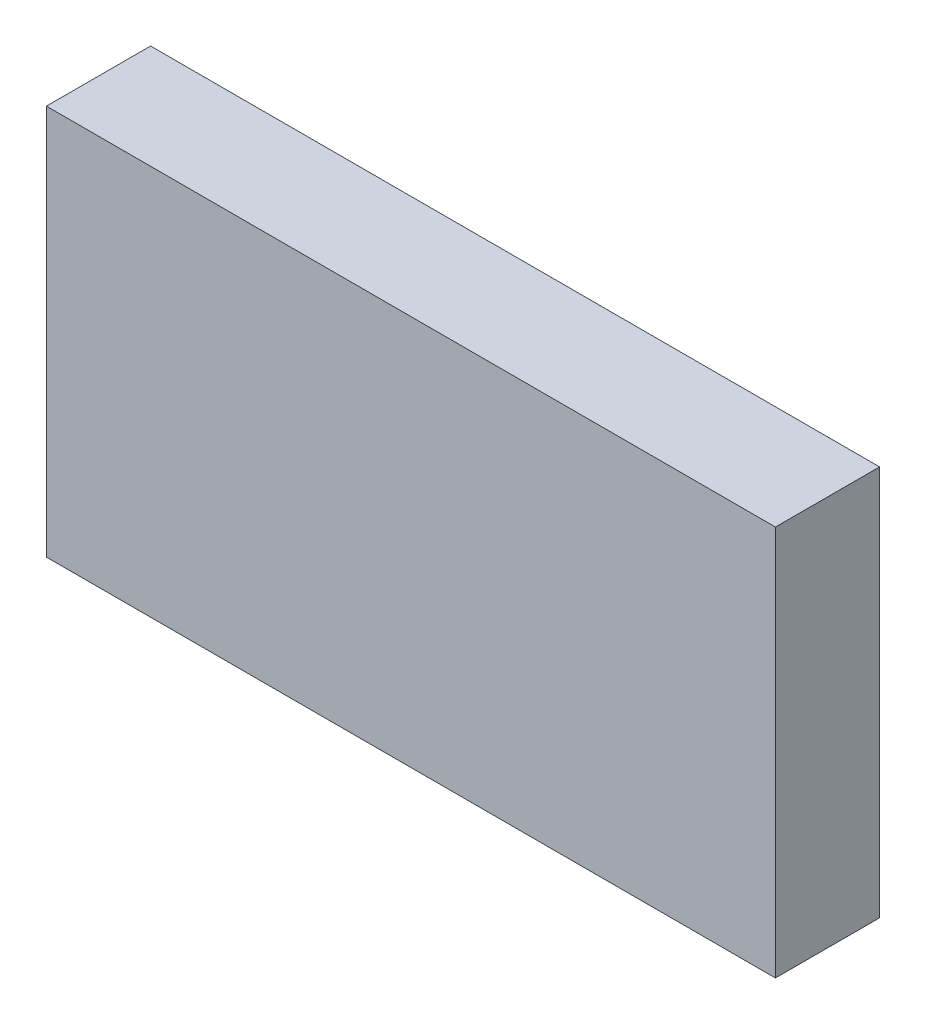
ISO-10303-21;
HEADER;
FILE_DESCRIPTION(('STEP AP214'),'2;1');
FILE_NAME('part.step','',(''),(''),'','','');
FILE_SCHEMA(('AUTOMOTIVE_DESIGN { 1 0 10303 214 1 1 1 1 }'));
ENDSEC;
DATA;
#1=APPLICATION_CONTEXT('core data for automotive mechanical design processes');
#2=APPLICATION_PROTOCOL_DEFINITION('international standard','automotive_design',2000,#1);
#3=PRODUCT_CONTEXT('',#1,'mechanical');
#4=PRODUCT('Part','Part','',(#3));
#5=PRODUCT_RELATED_PRODUCT_CATEGORY('part','',(#4));
#6=PRODUCT_DEFINITION_FORMATION('','',#4);
#7=PRODUCT_DEFINITION_CONTEXT('part definition',#1,'design');
#8=PRODUCT_DEFINITION('design','',#6,#7);
#9=PRODUCT_DEFINITION_SHAPE('','',#8);
#10=(LENGTH_UNIT() NAMED_UNIT(*) SI_UNIT(.MILLI.,.METRE.));
#11=(NAMED_UNIT(*) PLANE_ANGLE_UNIT() SI_UNIT($,.RADIAN.));
#12=(NAMED_UNIT(*) SI_UNIT($,.STERADIAN.) SOLID_ANGLE_UNIT());
#13=UNCERTAINTY_MEASURE_WITH_UNIT(LENGTH_MEASURE(1.E-05),#10,'distance_accuracy_value','');
#14=(GEOMETRIC_REPRESENTATION_CONTEXT(3) GLOBAL_UNCERTAINTY_ASSIGNED_CONTEXT((#13)) GLOBAL_UNIT_ASSIGNED_CONTEXT((#10,
#11,#12)) REPRESENTATION_CONTEXT('',''));
#15=CARTESIAN_POINT('',(0.,0.,0.));
#16=DIRECTION('',(0.,0.,1.));
#17=DIRECTION('',(1.,0.,0.));
#18=AXIS2_PLACEMENT_3D('',#15,#16,#17);
#19=CARTESIAN_POINT('',(-1.29732901160097,-0.654793790709493,0.0826433070866142));
#20=DIRECTION('',(0.,0.,-1.));
#21=DIRECTION('',(0.,1.,0.));
#22=AXIS2_PLACEMENT_3D('',#19,#20,#21);
#23=PLANE('',#22);
#24=DIRECTION('',(0.,1.,0.));
#25=VECTOR('',#24,1.);
#26=CARTESIAN_POINT('',(-1.29380145254586,-0.654793790709493,0.0826433070866142));
#27=LINE('',#26,#25);
#28=CARTESIAN_POINT('',(-1.29380145254586,-0.615108751339415,0.0826433070866142));
#29=VERTEX_POINT('',#28);
#30=CARTESIAN_POINT('',(-1.29380145254586,-0.652904026929966,0.0826433070866142));
#31=VERTEX_POINT('',#30);
#32=EDGE_CURVE('E71',#29,#31,#27,.F.);
#33=ORIENTED_EDGE('',*,*,#32,.T.);
#34=DIRECTION('',(1.,0.,0.));
#35=VECTOR('',#34,1.);
#36=CARTESIAN_POINT('',(-1.21972271238837,-0.652904026929966,0.0826433070866142));
#37=LINE('',#36,#35);
#38=CARTESIAN_POINT('',(-1.22325027144349,-0.652904026929966,0.0826433070866142));
#39=VERTEX_POINT('',#38);
#40=EDGE_CURVE('E54',#39,#31,#37,.F.);
#41=ORIENTED_EDGE('',*,*,#40,.F.);
#42=DIRECTION('',(0.,1.,0.));
#43=VECTOR('',#42,1.);
#44=CARTESIAN_POINT('',(-1.22325027144349,-0.654793790709493,0.0826433070866142));
#45=LINE('',#44,#43);
#46=CARTESIAN_POINT('',(-1.22325027144349,-0.615108751339415,0.0826433070866142));
#47=VERTEX_POINT('',#46);
#48=EDGE_CURVE('E20',#47,#39,#45,.F.);
#49=ORIENTED_EDGE('',*,*,#48,.F.);
#50=DIRECTION('',(1.,0.,0.));
#51=VECTOR('',#50,1.);
#52=CARTESIAN_POINT('',(-1.21972271238837,-0.615108751339415,0.0826433070866142));
#53=LINE('',#52,#51);
#54=EDGE_CURVE('E81',#29,#47,#53,.T.);
#55=ORIENTED_EDGE('',*,*,#54,.F.);
#56=EDGE_LOOP('',(#33,#41,#49,#55));
#57=FACE_BOUND('',#56,.T.);
#58=ADVANCED_FACE('F17',(#57),#23,.F.);
#59=CARTESIAN_POINT('',(-1.22325027144349,-0.654793790709493,0.0720606299212598));
#60=DIRECTION('',(-1.,0.,0.));
#61=DIRECTION('',(0.,0.,1.));
#62=AXIS2_PLACEMENT_3D('',#59,#60,#61);
#63=PLANE('',#62);
#64=DIRECTION('',(0.,0.,-1.));
#65=VECTOR('',#64,1.);
#66=CARTESIAN_POINT('',(-1.22325027144349,-0.615108751339415,0.0831472440944882));
#67=LINE('',#66,#65);
#68=CARTESIAN_POINT('',(-1.22325027144349,-0.615108751339414,0.0725645669291339));
#69=VERTEX_POINT('',#68);
#70=EDGE_CURVE('E64',#47,#69,#67,.T.);
#71=ORIENTED_EDGE('',*,*,#70,.F.);
#72=ORIENTED_EDGE('',*,*,#48,.T.);
#73=DIRECTION('',(0.,0.,1.));
#74=VECTOR('',#73,1.);
#75=CARTESIAN_POINT('',(-1.22325027144349,-0.652904026929966,0.0720606299212598));
#76=LINE('',#75,#74);
#77=CARTESIAN_POINT('',(-1.22325027144349,-0.652904026929966,0.0725645669291339));
#78=VERTEX_POINT('',#77);
#79=EDGE_CURVE('E62',#78,#39,#76,.T.);
#80=ORIENTED_EDGE('',*,*,#79,.F.);
#81=DIRECTION('',(0.,-1.,0.));
#82=VECTOR('',#81,1.);
#83=CARTESIAN_POINT('',(-1.22325027144349,-0.654793790709493,0.0725645669291339));
#84=LINE('',#83,#82);
#85=EDGE_CURVE('E83',#69,#78,#84,.T.);
#86=ORIENTED_EDGE('',*,*,#85,.F.);
#87=EDGE_LOOP('',(#71,#72,#80,#86));
#88=FACE_BOUND('',#87,.T.);
#89=ADVANCED_FACE('F60',(#88),#63,.F.);
#90=CARTESIAN_POINT('',(-1.21972271238837,-0.652904026929966,0.0720606299212598));
#91=DIRECTION('',(0.,1.,0.));
#92=DIRECTION('',(0.,0.,1.));
#93=AXIS2_PLACEMENT_3D('',#90,#91,#92);
#94=PLANE('',#93);
#95=DIRECTION('',(0.,0.,1.));
#96=VECTOR('',#95,1.);
#97=CARTESIAN_POINT('',(-1.29380145254586,-0.652904026929966,0.0720606299212598));
#98=LINE('',#97,#96);
#99=CARTESIAN_POINT('',(-1.29380145254586,-0.652904026929966,0.0725645669291339));
#100=VERTEX_POINT('',#99);
#101=EDGE_CURVE('E73',#31,#100,#98,.F.);
#102=ORIENTED_EDGE('',*,*,#101,.T.);
#103=DIRECTION('',(1.,0.,0.));
#104=VECTOR('',#103,1.);
#105=CARTESIAN_POINT('',(-1.21972271238837,-0.652904026929966,0.0725645669291339));
#106=LINE('',#105,#104);
#107=EDGE_CURVE('E69',#78,#100,#106,.F.);
#108=ORIENTED_EDGE('',*,*,#107,.F.);
#109=ORIENTED_EDGE('',*,*,#79,.T.);
#110=ORIENTED_EDGE('',*,*,#40,.T.);
#111=EDGE_LOOP('',(#102,#108,#109,#110));
#112=FACE_BOUND('',#111,.T.);
#113=ADVANCED_FACE('F68',(#112),#94,.F.);
#114=CARTESIAN_POINT('',(-1.29380145254586,-0.654793790709493,0.0720606299212598));
#115=DIRECTION('',(-1.,0.,0.));
#116=DIRECTION('',(0.,0.,1.));
#117=AXIS2_PLACEMENT_3D('',#114,#115,#116);
#118=PLANE('',#117);
#119=ORIENTED_EDGE('',*,*,#32,.F.);
#120=DIRECTION('',(0.,0.,-1.));
#121=VECTOR('',#120,1.);
#122=CARTESIAN_POINT('',(-1.29380145254586,-0.615108751339415,0.0831472440944882));
#123=LINE('',#122,#121);
#124=CARTESIAN_POINT('',(-1.29380145254586,-0.615108751339414,0.0725645669291339));
#125=VERTEX_POINT('',#124);
#126=EDGE_CURVE('E78',#125,#29,#123,.F.);
#127=ORIENTED_EDGE('',*,*,#126,.F.);
#128=DIRECTION('',(0.,-1.,0.));
#129=VECTOR('',#128,1.);
#130=CARTESIAN_POINT('',(-1.29380145254586,-0.654793790709493,0.0725645669291339));
#131=LINE('',#130,#129);
#132=EDGE_CURVE('E26',#100,#125,#131,.F.);
#133=ORIENTED_EDGE('',*,*,#132,.F.);
#134=ORIENTED_EDGE('',*,*,#101,.F.);
#135=EDGE_LOOP('',(#119,#127,#133,#134));
#136=FACE_BOUND('',#135,.T.);
#137=ADVANCED_FACE('F88',(#136),#118,.T.);
#138=CARTESIAN_POINT('',(-1.21972271238837,-0.615108751339415,0.0831472440944882));
#139=DIRECTION('',(0.,-1.,0.));
#140=DIRECTION('',(0.,0.,-1.));
#141=AXIS2_PLACEMENT_3D('',#138,#139,#140);
#142=PLANE('',#141);
#143=ORIENTED_EDGE('',*,*,#126,.T.);
#144=ORIENTED_EDGE('',*,*,#54,.T.);
#145=ORIENTED_EDGE('',*,*,#70,.T.);
#146=DIRECTION('',(1.,0.,0.));
#147=VECTOR('',#146,1.);
#148=CARTESIAN_POINT('',(-1.21972271238837,-0.615108751339414,0.0725645669291339));
#149=LINE('',#148,#147);
#150=EDGE_CURVE('E11',#125,#69,#149,.T.);
#151=ORIENTED_EDGE('',*,*,#150,.F.);
#152=EDGE_LOOP('',(#143,#144,#145,#151));
#153=FACE_BOUND('',#152,.T.);
#154=ADVANCED_FACE('F91',(#153),#142,.F.);
#155=CARTESIAN_POINT('',(-1.21972271238837,-0.654793790709493,0.0725645669291339));
#156=DIRECTION('',(0.,0.,1.));
#157=DIRECTION('',(0.,-1.,0.));
#158=AXIS2_PLACEMENT_3D('',#155,#156,#157);
#159=PLANE('',#158);
#160=ORIENTED_EDGE('',*,*,#132,.T.);
#161=ORIENTED_EDGE('',*,*,#150,.T.);
#162=ORIENTED_EDGE('',*,*,#85,.T.);
#163=ORIENTED_EDGE('',*,*,#107,.T.);
#164=EDGE_LOOP('',(#160,#161,#162,#163));
#165=FACE_BOUND('',#164,.T.);
#166=ADVANCED_FACE('F86',(#165),#159,.F.);
#167=CLOSED_SHELL('',(#58,#89,#113,#137,#154,#166));
#168=MANIFOLD_SOLID_BREP('B1',#167);
#169=ADVANCED_BREP_SHAPE_REPRESENTATION('',(#18,#168),#14);
#170=SHAPE_DEFINITION_REPRESENTATION(#9,#169);
ENDSEC;
END-ISO-10303-21;
